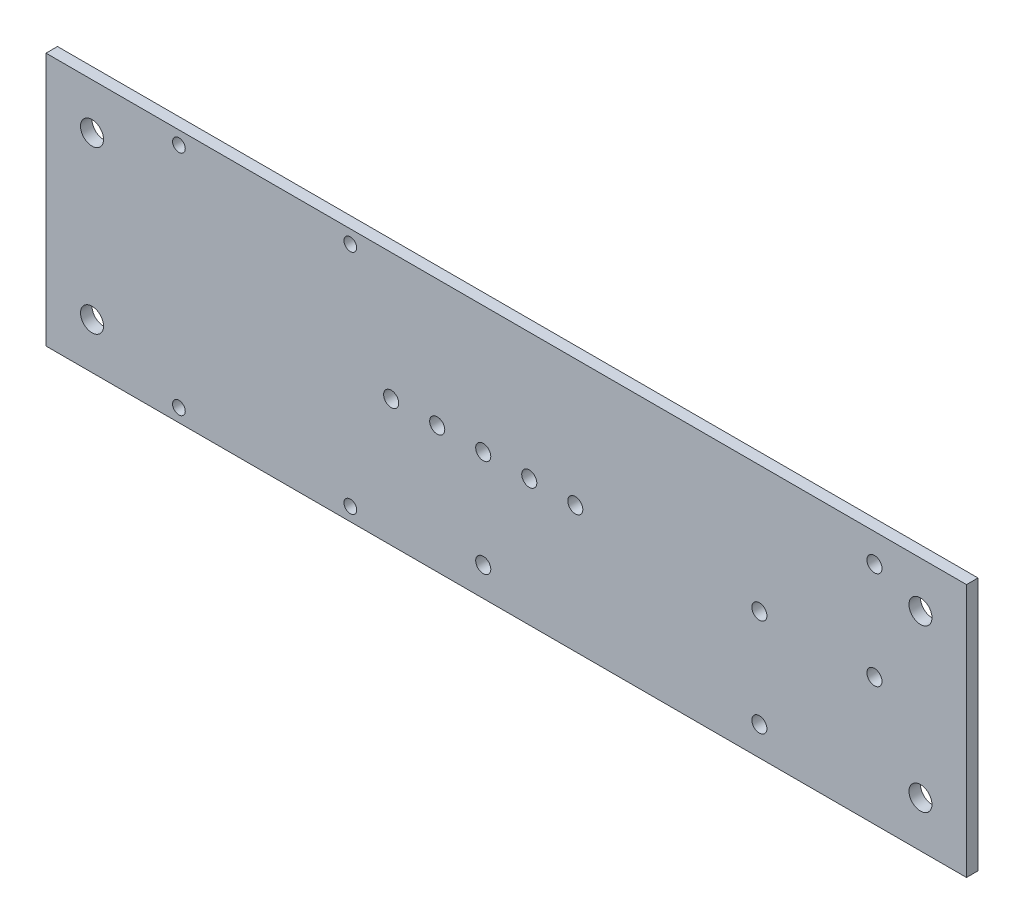
ISO-10303-21;
HEADER;
FILE_DESCRIPTION(('STEP AP214'),'2;1');
FILE_NAME('part.step','',(''),(''),'','','');
FILE_SCHEMA(('AUTOMOTIVE_DESIGN { 1 0 10303 214 1 1 1 1 }'));
ENDSEC;
DATA;
#1=APPLICATION_CONTEXT('core data for automotive mechanical design processes');
#2=APPLICATION_PROTOCOL_DEFINITION('international standard','automotive_design',2000,#1);
#3=PRODUCT_CONTEXT('',#1,'mechanical');
#4=PRODUCT('Part','Part','',(#3));
#5=PRODUCT_RELATED_PRODUCT_CATEGORY('part','',(#4));
#6=PRODUCT_DEFINITION_FORMATION('','',#4);
#7=PRODUCT_DEFINITION_CONTEXT('part definition',#1,'design');
#8=PRODUCT_DEFINITION('design','',#6,#7);
#9=PRODUCT_DEFINITION_SHAPE('','',#8);
#10=(LENGTH_UNIT() NAMED_UNIT(*) SI_UNIT(.MILLI.,.METRE.));
#11=(NAMED_UNIT(*) PLANE_ANGLE_UNIT() SI_UNIT($,.RADIAN.));
#12=(NAMED_UNIT(*) SI_UNIT($,.STERADIAN.) SOLID_ANGLE_UNIT());
#13=UNCERTAINTY_MEASURE_WITH_UNIT(LENGTH_MEASURE(1.E-05),#10,'distance_accuracy_value','');
#14=(GEOMETRIC_REPRESENTATION_CONTEXT(3) GLOBAL_UNCERTAINTY_ASSIGNED_CONTEXT((#13)) GLOBAL_UNIT_ASSIGNED_CONTEXT((#10,
#11,#12)) REPRESENTATION_CONTEXT('',''));
#15=CARTESIAN_POINT('',(0.,0.,0.));
#16=DIRECTION('',(0.,0.,1.));
#17=DIRECTION('',(1.,0.,0.));
#18=AXIS2_PLACEMENT_3D('',#15,#16,#17);
#19=CARTESIAN_POINT('',(0.,0.,3.175));
#20=DIRECTION('',(1.,0.,0.));
#21=DIRECTION('',(0.,0.,-1.));
#22=AXIS2_PLACEMENT_3D('',#19,#20,#21);
#23=PLANE('',#22);
#24=DIRECTION('',(0.,-1.,0.));
#25=VECTOR('',#24,1.);
#26=CARTESIAN_POINT('',(0.,0.,0.));
#27=LINE('',#26,#25);
#28=CARTESIAN_POINT('',(0.,70.,0.));
#29=VERTEX_POINT('',#28);
#30=CARTESIAN_POINT('',(0.,0.,0.));
#31=VERTEX_POINT('',#30);
#32=EDGE_CURVE('E100',#29,#31,#27,.T.);
#33=ORIENTED_EDGE('',*,*,#32,.T.);
#34=DIRECTION('',(0.,0.,-1.));
#35=VECTOR('',#34,1.);
#36=CARTESIAN_POINT('',(0.,0.,3.175));
#37=LINE('',#36,#35);
#38=CARTESIAN_POINT('',(0.,0.,3.175));
#39=VERTEX_POINT('',#38);
#40=EDGE_CURVE('E11',#39,#31,#37,.T.);
#41=ORIENTED_EDGE('',*,*,#40,.F.);
#42=DIRECTION('',(0.,-1.,0.));
#43=VECTOR('',#42,1.);
#44=CARTESIAN_POINT('',(0.,0.,3.175));
#45=LINE('',#44,#43);
#46=CARTESIAN_POINT('',(0.,70.,3.175));
#47=VERTEX_POINT('',#46);
#48=EDGE_CURVE('E88',#47,#39,#45,.T.);
#49=ORIENTED_EDGE('',*,*,#48,.F.);
#50=DIRECTION('',(0.,0.,-1.));
#51=VECTOR('',#50,1.);
#52=CARTESIAN_POINT('',(0.,70.,3.175));
#53=LINE('',#52,#51);
#54=EDGE_CURVE('E96',#47,#29,#53,.T.);
#55=ORIENTED_EDGE('',*,*,#54,.T.);
#56=EDGE_LOOP('',(#33,#41,#49,#55));
#57=FACE_BOUND('',#56,.T.);
#58=ADVANCED_FACE('F37',(#57),#23,.F.);
#59=CARTESIAN_POINT('',(0.,0.,3.175));
#60=DIRECTION('',(0.,1.,0.));
#61=DIRECTION('',(0.,0.,1.));
#62=AXIS2_PLACEMENT_3D('',#59,#60,#61);
#63=PLANE('',#62);
#64=DIRECTION('',(1.,0.,0.));
#65=VECTOR('',#64,1.);
#66=CARTESIAN_POINT('',(0.,0.,0.));
#67=LINE('',#66,#65);
#68=CARTESIAN_POINT('',(254.,0.,0.));
#69=VERTEX_POINT('',#68);
#70=EDGE_CURVE('E92',#31,#69,#67,.T.);
#71=ORIENTED_EDGE('',*,*,#70,.T.);
#72=DIRECTION('',(0.,0.,-1.));
#73=VECTOR('',#72,1.);
#74=CARTESIAN_POINT('',(254.,0.,3.175));
#75=LINE('',#74,#73);
#76=CARTESIAN_POINT('',(254.,0.,3.175));
#77=VERTEX_POINT('',#76);
#78=EDGE_CURVE('E45',#77,#69,#75,.T.);
#79=ORIENTED_EDGE('',*,*,#78,.F.);
#80=DIRECTION('',(1.,0.,0.));
#81=VECTOR('',#80,1.);
#82=CARTESIAN_POINT('',(0.,0.,3.175));
#83=LINE('',#82,#81);
#84=EDGE_CURVE('E83',#39,#77,#83,.T.);
#85=ORIENTED_EDGE('',*,*,#84,.F.);
#86=ORIENTED_EDGE('',*,*,#40,.T.);
#87=EDGE_LOOP('',(#71,#79,#85,#86));
#88=FACE_BOUND('',#87,.T.);
#89=ADVANCED_FACE('F91',(#88),#63,.F.);
#90=CARTESIAN_POINT('',(254.,0.,3.175));
#91=DIRECTION('',(-1.,0.,0.));
#92=DIRECTION('',(0.,0.,1.));
#93=AXIS2_PLACEMENT_3D('',#90,#91,#92);
#94=PLANE('',#93);
#95=DIRECTION('',(0.,1.,0.));
#96=VECTOR('',#95,1.);
#97=CARTESIAN_POINT('',(254.,0.,0.));
#98=LINE('',#97,#96);
#99=CARTESIAN_POINT('',(254.,70.,0.));
#100=VERTEX_POINT('',#99);
#101=EDGE_CURVE('E70',#69,#100,#98,.T.);
#102=ORIENTED_EDGE('',*,*,#101,.T.);
#103=DIRECTION('',(0.,0.,-1.));
#104=VECTOR('',#103,1.);
#105=CARTESIAN_POINT('',(254.,70.,3.175));
#106=LINE('',#105,#104);
#107=CARTESIAN_POINT('',(254.,70.,3.175));
#108=VERTEX_POINT('',#107);
#109=EDGE_CURVE('E93',#108,#100,#106,.T.);
#110=ORIENTED_EDGE('',*,*,#109,.F.);
#111=DIRECTION('',(0.,1.,0.));
#112=VECTOR('',#111,1.);
#113=CARTESIAN_POINT('',(254.,0.,3.175));
#114=LINE('',#113,#112);
#115=EDGE_CURVE('E86',#77,#108,#114,.T.);
#116=ORIENTED_EDGE('',*,*,#115,.F.);
#117=ORIENTED_EDGE('',*,*,#78,.T.);
#118=EDGE_LOOP('',(#102,#110,#116,#117));
#119=FACE_BOUND('',#118,.T.);
#120=ADVANCED_FACE('F94',(#119),#94,.F.);
#121=CARTESIAN_POINT('',(0.,70.,3.175));
#122=DIRECTION('',(0.,-1.,0.));
#123=DIRECTION('',(0.,0.,-1.));
#124=AXIS2_PLACEMENT_3D('',#121,#122,#123);
#125=PLANE('',#124);
#126=DIRECTION('',(-1.,0.,0.));
#127=VECTOR('',#126,1.);
#128=CARTESIAN_POINT('',(0.,70.,0.));
#129=LINE('',#128,#127);
#130=EDGE_CURVE('E76',#100,#29,#129,.T.);
#131=ORIENTED_EDGE('',*,*,#130,.T.);
#132=ORIENTED_EDGE('',*,*,#54,.F.);
#133=DIRECTION('',(-1.,0.,0.));
#134=VECTOR('',#133,1.);
#135=CARTESIAN_POINT('',(0.,70.,3.175));
#136=LINE('',#135,#134);
#137=EDGE_CURVE('E53',#108,#47,#136,.T.);
#138=ORIENTED_EDGE('',*,*,#137,.F.);
#139=ORIENTED_EDGE('',*,*,#109,.T.);
#140=EDGE_LOOP('',(#131,#132,#138,#139));
#141=FACE_BOUND('',#140,.T.);
#142=ADVANCED_FACE('F108',(#141),#125,.F.);
#143=CARTESIAN_POINT('',(0.,0.,3.175));
#144=DIRECTION('',(0.,0.,-1.));
#145=DIRECTION('',(-1.,0.,0.));
#146=AXIS2_PLACEMENT_3D('',#143,#144,#145);
#147=PLANE('',#146);
#148=CARTESIAN_POINT('',(228.6,35.199898,3.175));
#149=DIRECTION('',(0.,0.,1.));
#150=DIRECTION('',(1.,0.,0.));
#151=AXIS2_PLACEMENT_3D('',#148,#149,#150);
#152=CIRCLE('',#151,2.0828);
#153=CARTESIAN_POINT('',(230.6828,35.199898,3.175));
#154=VERTEX_POINT('',#153);
#155=EDGE_CURVE('E218',#154,#154,#152,.T.);
#156=ORIENTED_EDGE('',*,*,#155,.F.);
#157=EDGE_LOOP('',(#156));
#158=FACE_BOUND('',#157,.T.);
#159=CARTESIAN_POINT('',(196.85,8.01250000000001,3.175));
#160=DIRECTION('',(0.,0.,1.));
#161=DIRECTION('',(1.,0.,0.));
#162=AXIS2_PLACEMENT_3D('',#159,#160,#161);
#163=CIRCLE('',#162,2.0828);
#164=CARTESIAN_POINT('',(198.9328,8.01250000000001,3.175));
#165=VERTEX_POINT('',#164);
#166=EDGE_CURVE('E212',#165,#165,#163,.T.);
#167=ORIENTED_EDGE('',*,*,#166,.F.);
#168=EDGE_LOOP('',(#167));
#169=FACE_BOUND('',#168,.T.);
#170=CARTESIAN_POINT('',(120.65,8.01250000000001,3.175));
#171=DIRECTION('',(0.,0.,1.));
#172=DIRECTION('',(1.,0.,0.));
#173=AXIS2_PLACEMENT_3D('',#170,#171,#172);
#174=CIRCLE('',#173,2.0828);
#175=CARTESIAN_POINT('',(122.7328,8.01250000000001,3.175));
#176=VERTEX_POINT('',#175);
#177=EDGE_CURVE('E206',#176,#176,#174,.T.);
#178=ORIENTED_EDGE('',*,*,#177,.F.);
#179=EDGE_LOOP('',(#178));
#180=FACE_BOUND('',#179,.T.);
#181=CARTESIAN_POINT('',(12.7,57.3,3.175));
#182=DIRECTION('',(0.,0.,1.));
#183=DIRECTION('',(1.,0.,0.));
#184=AXIS2_PLACEMENT_3D('',#181,#182,#183);
#185=CIRCLE('',#184,3.175);
#186=CARTESIAN_POINT('',(15.875,57.3,3.175));
#187=VERTEX_POINT('',#186);
#188=EDGE_CURVE('E200',#187,#187,#185,.T.);
#189=ORIENTED_EDGE('',*,*,#188,.F.);
#190=EDGE_LOOP('',(#189));
#191=FACE_BOUND('',#190,.T.);
#192=CARTESIAN_POINT('',(241.3,12.7,3.175));
#193=DIRECTION('',(0.,0.,1.));
#194=DIRECTION('',(1.,0.,0.));
#195=AXIS2_PLACEMENT_3D('',#192,#193,#194);
#196=CIRCLE('',#195,3.17500000000001);
#197=CARTESIAN_POINT('',(244.475,12.7,3.175));
#198=VERTEX_POINT('',#197);
#199=EDGE_CURVE('E194',#198,#198,#196,.T.);
#200=ORIENTED_EDGE('',*,*,#199,.F.);
#201=EDGE_LOOP('',(#200));
#202=FACE_BOUND('',#201,.T.);
#203=CARTESIAN_POINT('',(241.3,57.3,3.175));
#204=DIRECTION('',(0.,0.,1.));
#205=DIRECTION('',(1.,0.,0.));
#206=AXIS2_PLACEMENT_3D('',#203,#204,#205);
#207=CIRCLE('',#206,3.17500000000001);
#208=CARTESIAN_POINT('',(244.475,57.3,3.175));
#209=VERTEX_POINT('',#208);
#210=EDGE_CURVE('E188',#209,#209,#207,.T.);
#211=ORIENTED_EDGE('',*,*,#210,.F.);
#212=EDGE_LOOP('',(#211));
#213=FACE_BOUND('',#212,.T.);
#214=CARTESIAN_POINT('',(12.7,12.7,3.175));
#215=DIRECTION('',(0.,0.,1.));
#216=DIRECTION('',(1.,0.,0.));
#217=AXIS2_PLACEMENT_3D('',#214,#215,#216);
#218=CIRCLE('',#217,3.175);
#219=CARTESIAN_POINT('',(15.875,12.7,3.175));
#220=VERTEX_POINT('',#219);
#221=EDGE_CURVE('E182',#220,#220,#218,.T.);
#222=ORIENTED_EDGE('',*,*,#221,.F.);
#223=EDGE_LOOP('',(#222));
#224=FACE_BOUND('',#223,.T.);
#225=CARTESIAN_POINT('',(36.6736324724129,66.3681092284144,3.175));
#226=DIRECTION('',(0.,0.,1.));
#227=DIRECTION('',(1.,0.,0.));
#228=AXIS2_PLACEMENT_3D('',#225,#226,#227);
#229=CIRCLE('',#228,1.7526);
#230=CARTESIAN_POINT('',(38.4262324724129,66.3681092284144,3.175));
#231=VERTEX_POINT('',#230);
#232=EDGE_CURVE('E176',#231,#231,#229,.T.);
#233=ORIENTED_EDGE('',*,*,#232,.F.);
#234=EDGE_LOOP('',(#233));
#235=FACE_BOUND('',#234,.T.);
#236=CARTESIAN_POINT('',(83.9725886122595,66.3249191923123,3.175));
#237=DIRECTION('',(0.,0.,1.));
#238=DIRECTION('',(1.,0.,0.));
#239=AXIS2_PLACEMENT_3D('',#236,#237,#238);
#240=CIRCLE('',#239,1.75259999999999);
#241=CARTESIAN_POINT('',(85.7251886122595,66.3249191923123,3.175));
#242=VERTEX_POINT('',#241);
#243=EDGE_CURVE('E170',#242,#242,#240,.T.);
#244=ORIENTED_EDGE('',*,*,#243,.F.);
#245=EDGE_LOOP('',(#244));
#246=FACE_BOUND('',#245,.T.);
#247=CARTESIAN_POINT('',(83.9725886122595,3.67508080768771,3.175));
#248=DIRECTION('',(0.,0.,1.));
#249=DIRECTION('',(1.,0.,0.));
#250=AXIS2_PLACEMENT_3D('',#247,#248,#249);
#251=CIRCLE('',#250,1.75259999999999);
#252=CARTESIAN_POINT('',(85.7251886122595,3.67508080768771,3.175));
#253=VERTEX_POINT('',#252);
#254=EDGE_CURVE('E164',#253,#253,#251,.T.);
#255=ORIENTED_EDGE('',*,*,#254,.F.);
#256=EDGE_LOOP('',(#255));
#257=FACE_BOUND('',#256,.T.);
#258=CARTESIAN_POINT('',(36.6736324724129,3.63189077158564,3.175));
#259=DIRECTION('',(0.,0.,1.));
#260=DIRECTION('',(1.,0.,0.));
#261=AXIS2_PLACEMENT_3D('',#258,#259,#260);
#262=CIRCLE('',#261,1.7526);
#263=CARTESIAN_POINT('',(38.4262324724129,3.63189077158564,3.175));
#264=VERTEX_POINT('',#263);
#265=EDGE_CURVE('E158',#264,#264,#262,.T.);
#266=ORIENTED_EDGE('',*,*,#265,.F.);
#267=EDGE_LOOP('',(#266));
#268=FACE_BOUND('',#267,.T.);
#269=CARTESIAN_POINT('',(228.6,62.187398,3.175));
#270=DIRECTION('',(0.,0.,1.));
#271=DIRECTION('',(1.,0.,0.));
#272=AXIS2_PLACEMENT_3D('',#269,#270,#271);
#273=CIRCLE('',#272,2.0828);
#274=CARTESIAN_POINT('',(230.6828,62.187398,3.175));
#275=VERTEX_POINT('',#274);
#276=EDGE_CURVE('E152',#275,#275,#273,.T.);
#277=ORIENTED_EDGE('',*,*,#276,.F.);
#278=EDGE_LOOP('',(#277));
#279=FACE_BOUND('',#278,.T.);
#280=CARTESIAN_POINT('',(196.85,35.,3.175));
#281=DIRECTION('',(0.,0.,1.));
#282=DIRECTION('',(1.,0.,0.));
#283=AXIS2_PLACEMENT_3D('',#280,#281,#282);
#284=CIRCLE('',#283,2.0828);
#285=CARTESIAN_POINT('',(198.9328,35.,3.175));
#286=VERTEX_POINT('',#285);
#287=EDGE_CURVE('E146',#286,#286,#284,.T.);
#288=ORIENTED_EDGE('',*,*,#287,.F.);
#289=EDGE_LOOP('',(#288));
#290=FACE_BOUND('',#289,.T.);
#291=CARTESIAN_POINT('',(95.25,35.,3.175));
#292=DIRECTION('',(0.,0.,1.));
#293=DIRECTION('',(1.,0.,0.));
#294=AXIS2_PLACEMENT_3D('',#291,#292,#293);
#295=CIRCLE('',#294,2.0828);
#296=CARTESIAN_POINT('',(97.3328,35.,3.175));
#297=VERTEX_POINT('',#296);
#298=EDGE_CURVE('E140',#297,#297,#295,.T.);
#299=ORIENTED_EDGE('',*,*,#298,.F.);
#300=EDGE_LOOP('',(#299));
#301=FACE_BOUND('',#300,.T.);
#302=CARTESIAN_POINT('',(120.65,35.,3.175));
#303=DIRECTION('',(0.,0.,1.));
#304=DIRECTION('',(1.,0.,0.));
#305=AXIS2_PLACEMENT_3D('',#302,#303,#304);
#306=CIRCLE('',#305,2.08279999999998);
#307=CARTESIAN_POINT('',(122.7328,35.,3.175));
#308=VERTEX_POINT('',#307);
#309=EDGE_CURVE('E134',#308,#308,#306,.T.);
#310=ORIENTED_EDGE('',*,*,#309,.F.);
#311=EDGE_LOOP('',(#310));
#312=FACE_BOUND('',#311,.T.);
#313=CARTESIAN_POINT('',(146.05,35.,3.175));
#314=DIRECTION('',(0.,0.,1.));
#315=DIRECTION('',(1.,0.,0.));
#316=AXIS2_PLACEMENT_3D('',#313,#314,#315);
#317=CIRCLE('',#316,2.0828);
#318=CARTESIAN_POINT('',(148.1328,35.,3.175));
#319=VERTEX_POINT('',#318);
#320=EDGE_CURVE('E128',#319,#319,#317,.T.);
#321=ORIENTED_EDGE('',*,*,#320,.F.);
#322=EDGE_LOOP('',(#321));
#323=FACE_BOUND('',#322,.T.);
#324=CARTESIAN_POINT('',(133.35,35.,3.175));
#325=DIRECTION('',(0.,0.,1.));
#326=DIRECTION('',(1.,0.,0.));
#327=AXIS2_PLACEMENT_3D('',#324,#325,#326);
#328=CIRCLE('',#327,2.0828);
#329=CARTESIAN_POINT('',(135.4328,35.,3.175));
#330=VERTEX_POINT('',#329);
#331=EDGE_CURVE('E122',#330,#330,#328,.T.);
#332=ORIENTED_EDGE('',*,*,#331,.F.);
#333=EDGE_LOOP('',(#332));
#334=FACE_BOUND('',#333,.T.);
#335=CARTESIAN_POINT('',(107.95,35.,3.175));
#336=DIRECTION('',(0.,0.,1.));
#337=DIRECTION('',(1.,0.,0.));
#338=AXIS2_PLACEMENT_3D('',#335,#336,#337);
#339=CIRCLE('',#338,2.0828);
#340=CARTESIAN_POINT('',(110.0328,35.,3.175));
#341=VERTEX_POINT('',#340);
#342=EDGE_CURVE('E116',#341,#341,#339,.T.);
#343=ORIENTED_EDGE('',*,*,#342,.F.);
#344=EDGE_LOOP('',(#343));
#345=FACE_BOUND('',#344,.T.);
#346=ORIENTED_EDGE('',*,*,#48,.T.);
#347=ORIENTED_EDGE('',*,*,#84,.T.);
#348=ORIENTED_EDGE('',*,*,#115,.T.);
#349=ORIENTED_EDGE('',*,*,#137,.T.);
#350=EDGE_LOOP('',(#346,#347,#348,#349));
#351=FACE_BOUND('',#350,.T.);
#352=ADVANCED_FACE('F84',(#158,#169,#180,#191,#202,#213,#224,#235,#246,#257,#268,#279,#290,#301,
#312,#323,#334,#345,#351),#147,.F.);
#353=CARTESIAN_POINT('',(0.,0.,0.));
#354=DIRECTION('',(0.,0.,-1.));
#355=DIRECTION('',(-1.,0.,0.));
#356=AXIS2_PLACEMENT_3D('',#353,#354,#355);
#357=PLANE('',#356);
#358=CARTESIAN_POINT('',(228.6,35.199898,0.));
#359=DIRECTION('',(0.,0.,1.));
#360=DIRECTION('',(1.,0.,0.));
#361=AXIS2_PLACEMENT_3D('',#358,#359,#360);
#362=CIRCLE('',#361,2.0828);
#363=CARTESIAN_POINT('',(230.6828,35.199898,0.));
#364=VERTEX_POINT('',#363);
#365=EDGE_CURVE('E215',#364,#364,#362,.T.);
#366=ORIENTED_EDGE('',*,*,#365,.T.);
#367=EDGE_LOOP('',(#366));
#368=FACE_BOUND('',#367,.T.);
#369=CARTESIAN_POINT('',(196.85,8.01250000000001,0.));
#370=DIRECTION('',(0.,0.,1.));
#371=DIRECTION('',(1.,0.,0.));
#372=AXIS2_PLACEMENT_3D('',#369,#370,#371);
#373=CIRCLE('',#372,2.0828);
#374=CARTESIAN_POINT('',(198.9328,8.01250000000001,0.));
#375=VERTEX_POINT('',#374);
#376=EDGE_CURVE('E209',#375,#375,#373,.T.);
#377=ORIENTED_EDGE('',*,*,#376,.T.);
#378=EDGE_LOOP('',(#377));
#379=FACE_BOUND('',#378,.T.);
#380=CARTESIAN_POINT('',(120.65,8.01250000000001,0.));
#381=DIRECTION('',(0.,0.,1.));
#382=DIRECTION('',(1.,0.,0.));
#383=AXIS2_PLACEMENT_3D('',#380,#381,#382);
#384=CIRCLE('',#383,2.0828);
#385=CARTESIAN_POINT('',(122.7328,8.01250000000001,0.));
#386=VERTEX_POINT('',#385);
#387=EDGE_CURVE('E203',#386,#386,#384,.T.);
#388=ORIENTED_EDGE('',*,*,#387,.T.);
#389=EDGE_LOOP('',(#388));
#390=FACE_BOUND('',#389,.T.);
#391=CARTESIAN_POINT('',(12.7,57.3,0.));
#392=DIRECTION('',(0.,0.,1.));
#393=DIRECTION('',(1.,0.,0.));
#394=AXIS2_PLACEMENT_3D('',#391,#392,#393);
#395=CIRCLE('',#394,3.175);
#396=CARTESIAN_POINT('',(15.875,57.3,0.));
#397=VERTEX_POINT('',#396);
#398=EDGE_CURVE('E197',#397,#397,#395,.T.);
#399=ORIENTED_EDGE('',*,*,#398,.T.);
#400=EDGE_LOOP('',(#399));
#401=FACE_BOUND('',#400,.T.);
#402=CARTESIAN_POINT('',(241.3,12.7,0.));
#403=DIRECTION('',(0.,0.,1.));
#404=DIRECTION('',(1.,0.,0.));
#405=AXIS2_PLACEMENT_3D('',#402,#403,#404);
#406=CIRCLE('',#405,3.17500000000001);
#407=CARTESIAN_POINT('',(244.475,12.7,0.));
#408=VERTEX_POINT('',#407);
#409=EDGE_CURVE('E191',#408,#408,#406,.T.);
#410=ORIENTED_EDGE('',*,*,#409,.T.);
#411=EDGE_LOOP('',(#410));
#412=FACE_BOUND('',#411,.T.);
#413=CARTESIAN_POINT('',(241.3,57.3,0.));
#414=DIRECTION('',(0.,0.,1.));
#415=DIRECTION('',(1.,0.,0.));
#416=AXIS2_PLACEMENT_3D('',#413,#414,#415);
#417=CIRCLE('',#416,3.17500000000001);
#418=CARTESIAN_POINT('',(244.475,57.3,0.));
#419=VERTEX_POINT('',#418);
#420=EDGE_CURVE('E185',#419,#419,#417,.T.);
#421=ORIENTED_EDGE('',*,*,#420,.T.);
#422=EDGE_LOOP('',(#421));
#423=FACE_BOUND('',#422,.T.);
#424=CARTESIAN_POINT('',(12.7,12.7,0.));
#425=DIRECTION('',(0.,0.,1.));
#426=DIRECTION('',(1.,0.,0.));
#427=AXIS2_PLACEMENT_3D('',#424,#425,#426);
#428=CIRCLE('',#427,3.175);
#429=CARTESIAN_POINT('',(15.875,12.7,0.));
#430=VERTEX_POINT('',#429);
#431=EDGE_CURVE('E179',#430,#430,#428,.T.);
#432=ORIENTED_EDGE('',*,*,#431,.T.);
#433=EDGE_LOOP('',(#432));
#434=FACE_BOUND('',#433,.T.);
#435=CARTESIAN_POINT('',(36.6736324724129,66.3681092284144,0.));
#436=DIRECTION('',(0.,0.,1.));
#437=DIRECTION('',(1.,0.,0.));
#438=AXIS2_PLACEMENT_3D('',#435,#436,#437);
#439=CIRCLE('',#438,1.7526);
#440=CARTESIAN_POINT('',(38.4262324724129,66.3681092284144,0.));
#441=VERTEX_POINT('',#440);
#442=EDGE_CURVE('E173',#441,#441,#439,.T.);
#443=ORIENTED_EDGE('',*,*,#442,.T.);
#444=EDGE_LOOP('',(#443));
#445=FACE_BOUND('',#444,.T.);
#446=CARTESIAN_POINT('',(83.9725886122595,66.3249191923123,0.));
#447=DIRECTION('',(0.,0.,1.));
#448=DIRECTION('',(1.,0.,0.));
#449=AXIS2_PLACEMENT_3D('',#446,#447,#448);
#450=CIRCLE('',#449,1.75259999999999);
#451=CARTESIAN_POINT('',(85.7251886122595,66.3249191923123,0.));
#452=VERTEX_POINT('',#451);
#453=EDGE_CURVE('E167',#452,#452,#450,.T.);
#454=ORIENTED_EDGE('',*,*,#453,.T.);
#455=EDGE_LOOP('',(#454));
#456=FACE_BOUND('',#455,.T.);
#457=CARTESIAN_POINT('',(83.9725886122595,3.67508080768771,0.));
#458=DIRECTION('',(0.,0.,1.));
#459=DIRECTION('',(1.,0.,0.));
#460=AXIS2_PLACEMENT_3D('',#457,#458,#459);
#461=CIRCLE('',#460,1.75259999999999);
#462=CARTESIAN_POINT('',(85.7251886122595,3.67508080768771,0.));
#463=VERTEX_POINT('',#462);
#464=EDGE_CURVE('E161',#463,#463,#461,.T.);
#465=ORIENTED_EDGE('',*,*,#464,.T.);
#466=EDGE_LOOP('',(#465));
#467=FACE_BOUND('',#466,.T.);
#468=CARTESIAN_POINT('',(36.6736324724129,3.63189077158564,0.));
#469=DIRECTION('',(0.,0.,1.));
#470=DIRECTION('',(1.,0.,0.));
#471=AXIS2_PLACEMENT_3D('',#468,#469,#470);
#472=CIRCLE('',#471,1.7526);
#473=CARTESIAN_POINT('',(38.4262324724129,3.63189077158564,0.));
#474=VERTEX_POINT('',#473);
#475=EDGE_CURVE('E155',#474,#474,#472,.T.);
#476=ORIENTED_EDGE('',*,*,#475,.T.);
#477=EDGE_LOOP('',(#476));
#478=FACE_BOUND('',#477,.T.);
#479=CARTESIAN_POINT('',(228.6,62.187398,0.));
#480=DIRECTION('',(0.,0.,1.));
#481=DIRECTION('',(1.,0.,0.));
#482=AXIS2_PLACEMENT_3D('',#479,#480,#481);
#483=CIRCLE('',#482,2.0828);
#484=CARTESIAN_POINT('',(230.6828,62.187398,0.));
#485=VERTEX_POINT('',#484);
#486=EDGE_CURVE('E149',#485,#485,#483,.T.);
#487=ORIENTED_EDGE('',*,*,#486,.T.);
#488=EDGE_LOOP('',(#487));
#489=FACE_BOUND('',#488,.T.);
#490=CARTESIAN_POINT('',(196.85,35.,0.));
#491=DIRECTION('',(0.,0.,1.));
#492=DIRECTION('',(1.,0.,0.));
#493=AXIS2_PLACEMENT_3D('',#490,#491,#492);
#494=CIRCLE('',#493,2.0828);
#495=CARTESIAN_POINT('',(198.9328,35.,0.));
#496=VERTEX_POINT('',#495);
#497=EDGE_CURVE('E143',#496,#496,#494,.T.);
#498=ORIENTED_EDGE('',*,*,#497,.T.);
#499=EDGE_LOOP('',(#498));
#500=FACE_BOUND('',#499,.T.);
#501=CARTESIAN_POINT('',(95.25,35.,0.));
#502=DIRECTION('',(0.,0.,1.));
#503=DIRECTION('',(1.,0.,0.));
#504=AXIS2_PLACEMENT_3D('',#501,#502,#503);
#505=CIRCLE('',#504,2.0828);
#506=CARTESIAN_POINT('',(97.3328,35.,0.));
#507=VERTEX_POINT('',#506);
#508=EDGE_CURVE('E137',#507,#507,#505,.T.);
#509=ORIENTED_EDGE('',*,*,#508,.T.);
#510=EDGE_LOOP('',(#509));
#511=FACE_BOUND('',#510,.T.);
#512=CARTESIAN_POINT('',(120.65,35.,0.));
#513=DIRECTION('',(0.,0.,1.));
#514=DIRECTION('',(1.,0.,0.));
#515=AXIS2_PLACEMENT_3D('',#512,#513,#514);
#516=CIRCLE('',#515,2.0828);
#517=CARTESIAN_POINT('',(122.7328,35.,0.));
#518=VERTEX_POINT('',#517);
#519=EDGE_CURVE('E131',#518,#518,#516,.T.);
#520=ORIENTED_EDGE('',*,*,#519,.T.);
#521=EDGE_LOOP('',(#520));
#522=FACE_BOUND('',#521,.T.);
#523=CARTESIAN_POINT('',(146.05,35.,0.));
#524=DIRECTION('',(0.,0.,1.));
#525=DIRECTION('',(1.,0.,0.));
#526=AXIS2_PLACEMENT_3D('',#523,#524,#525);
#527=CIRCLE('',#526,2.0828);
#528=CARTESIAN_POINT('',(148.1328,35.,0.));
#529=VERTEX_POINT('',#528);
#530=EDGE_CURVE('E125',#529,#529,#527,.T.);
#531=ORIENTED_EDGE('',*,*,#530,.T.);
#532=EDGE_LOOP('',(#531));
#533=FACE_BOUND('',#532,.T.);
#534=CARTESIAN_POINT('',(133.35,35.,0.));
#535=DIRECTION('',(0.,0.,1.));
#536=DIRECTION('',(1.,0.,0.));
#537=AXIS2_PLACEMENT_3D('',#534,#535,#536);
#538=CIRCLE('',#537,2.0828);
#539=CARTESIAN_POINT('',(135.4328,35.,0.));
#540=VERTEX_POINT('',#539);
#541=EDGE_CURVE('E119',#540,#540,#538,.T.);
#542=ORIENTED_EDGE('',*,*,#541,.T.);
#543=EDGE_LOOP('',(#542));
#544=FACE_BOUND('',#543,.T.);
#545=CARTESIAN_POINT('',(107.95,35.,0.));
#546=DIRECTION('',(0.,0.,1.));
#547=DIRECTION('',(1.,0.,0.));
#548=AXIS2_PLACEMENT_3D('',#545,#546,#547);
#549=CIRCLE('',#548,2.0828);
#550=CARTESIAN_POINT('',(110.0328,35.,0.));
#551=VERTEX_POINT('',#550);
#552=EDGE_CURVE('E103',#551,#551,#549,.T.);
#553=ORIENTED_EDGE('',*,*,#552,.T.);
#554=EDGE_LOOP('',(#553));
#555=FACE_BOUND('',#554,.T.);
#556=ORIENTED_EDGE('',*,*,#32,.F.);
#557=ORIENTED_EDGE('',*,*,#130,.F.);
#558=ORIENTED_EDGE('',*,*,#101,.F.);
#559=ORIENTED_EDGE('',*,*,#70,.F.);
#560=EDGE_LOOP('',(#556,#557,#558,#559));
#561=FACE_BOUND('',#560,.T.);
#562=ADVANCED_FACE('F111',(#368,#379,#390,#401,#412,#423,#434,#445,#456,#467,#478,#489,#500,
#511,#522,#533,#544,#555,#561),#357,.T.);
#563=CARTESIAN_POINT('',(107.95,35.,3.175));
#564=DIRECTION('',(0.,0.,1.));
#565=DIRECTION('',(1.,0.,0.));
#566=AXIS2_PLACEMENT_3D('',#563,#564,#565);
#567=CYLINDRICAL_SURFACE('',#566,2.0828);
#568=ORIENTED_EDGE('',*,*,#552,.F.);
#569=EDGE_LOOP('',(#568));
#570=FACE_BOUND('',#569,.T.);
#571=ORIENTED_EDGE('',*,*,#342,.T.);
#572=EDGE_LOOP('',(#571));
#573=FACE_BOUND('',#572,.T.);
#574=ADVANCED_FACE('F261',(#570,#573),#567,.F.);
#575=CARTESIAN_POINT('',(133.35,35.,3.175));
#576=DIRECTION('',(0.,0.,1.));
#577=DIRECTION('',(1.,0.,0.));
#578=AXIS2_PLACEMENT_3D('',#575,#576,#577);
#579=CYLINDRICAL_SURFACE('',#578,2.0828);
#580=ORIENTED_EDGE('',*,*,#541,.F.);
#581=EDGE_LOOP('',(#580));
#582=FACE_BOUND('',#581,.T.);
#583=ORIENTED_EDGE('',*,*,#331,.T.);
#584=EDGE_LOOP('',(#583));
#585=FACE_BOUND('',#584,.T.);
#586=ADVANCED_FACE('F263',(#582,#585),#579,.F.);
#587=CARTESIAN_POINT('',(146.05,35.,3.175));
#588=DIRECTION('',(0.,0.,1.));
#589=DIRECTION('',(1.,0.,0.));
#590=AXIS2_PLACEMENT_3D('',#587,#588,#589);
#591=CYLINDRICAL_SURFACE('',#590,2.0828);
#592=ORIENTED_EDGE('',*,*,#530,.F.);
#593=EDGE_LOOP('',(#592));
#594=FACE_BOUND('',#593,.T.);
#595=ORIENTED_EDGE('',*,*,#320,.T.);
#596=EDGE_LOOP('',(#595));
#597=FACE_BOUND('',#596,.T.);
#598=ADVANCED_FACE('F270',(#594,#597),#591,.F.);
#599=CARTESIAN_POINT('',(120.65,35.,3.175));
#600=DIRECTION('',(0.,0.,1.));
#601=DIRECTION('',(1.,0.,0.));
#602=AXIS2_PLACEMENT_3D('',#599,#600,#601);
#603=CYLINDRICAL_SURFACE('',#602,2.08279999999999);
#604=ORIENTED_EDGE('',*,*,#519,.F.);
#605=EDGE_LOOP('',(#604));
#606=FACE_BOUND('',#605,.T.);
#607=ORIENTED_EDGE('',*,*,#309,.T.);
#608=EDGE_LOOP('',(#607));
#609=FACE_BOUND('',#608,.T.);
#610=ADVANCED_FACE('F379',(#606,#609),#603,.F.);
#611=CARTESIAN_POINT('',(95.25,35.,3.175));
#612=DIRECTION('',(0.,0.,1.));
#613=DIRECTION('',(1.,0.,0.));
#614=AXIS2_PLACEMENT_3D('',#611,#612,#613);
#615=CYLINDRICAL_SURFACE('',#614,2.0828);
#616=ORIENTED_EDGE('',*,*,#508,.F.);
#617=EDGE_LOOP('',(#616));
#618=FACE_BOUND('',#617,.T.);
#619=ORIENTED_EDGE('',*,*,#298,.T.);
#620=EDGE_LOOP('',(#619));
#621=FACE_BOUND('',#620,.T.);
#622=ADVANCED_FACE('F375',(#618,#621),#615,.F.);
#623=CARTESIAN_POINT('',(196.85,35.,3.175));
#624=DIRECTION('',(0.,0.,1.));
#625=DIRECTION('',(1.,0.,0.));
#626=AXIS2_PLACEMENT_3D('',#623,#624,#625);
#627=CYLINDRICAL_SURFACE('',#626,2.0828);
#628=ORIENTED_EDGE('',*,*,#497,.F.);
#629=EDGE_LOOP('',(#628));
#630=FACE_BOUND('',#629,.T.);
#631=ORIENTED_EDGE('',*,*,#287,.T.);
#632=EDGE_LOOP('',(#631));
#633=FACE_BOUND('',#632,.T.);
#634=ADVANCED_FACE('F371',(#630,#633),#627,.F.);
#635=CARTESIAN_POINT('',(228.6,62.187398,3.175));
#636=DIRECTION('',(0.,0.,1.));
#637=DIRECTION('',(1.,0.,0.));
#638=AXIS2_PLACEMENT_3D('',#635,#636,#637);
#639=CYLINDRICAL_SURFACE('',#638,2.0828);
#640=ORIENTED_EDGE('',*,*,#486,.F.);
#641=EDGE_LOOP('',(#640));
#642=FACE_BOUND('',#641,.T.);
#643=ORIENTED_EDGE('',*,*,#276,.T.);
#644=EDGE_LOOP('',(#643));
#645=FACE_BOUND('',#644,.T.);
#646=ADVANCED_FACE('F367',(#642,#645),#639,.F.);
#647=CARTESIAN_POINT('',(36.6736324724129,3.63189077158564,3.175));
#648=DIRECTION('',(0.,0.,1.));
#649=DIRECTION('',(1.,0.,0.));
#650=AXIS2_PLACEMENT_3D('',#647,#648,#649);
#651=CYLINDRICAL_SURFACE('',#650,1.7526);
#652=ORIENTED_EDGE('',*,*,#475,.F.);
#653=EDGE_LOOP('',(#652));
#654=FACE_BOUND('',#653,.T.);
#655=ORIENTED_EDGE('',*,*,#265,.T.);
#656=EDGE_LOOP('',(#655));
#657=FACE_BOUND('',#656,.T.);
#658=ADVANCED_FACE('F363',(#654,#657),#651,.F.);
#659=CARTESIAN_POINT('',(83.9725886122595,3.67508080768771,3.175));
#660=DIRECTION('',(0.,0.,1.));
#661=DIRECTION('',(1.,0.,0.));
#662=AXIS2_PLACEMENT_3D('',#659,#660,#661);
#663=CYLINDRICAL_SURFACE('',#662,1.75259999999999);
#664=ORIENTED_EDGE('',*,*,#464,.F.);
#665=EDGE_LOOP('',(#664));
#666=FACE_BOUND('',#665,.T.);
#667=ORIENTED_EDGE('',*,*,#254,.T.);
#668=EDGE_LOOP('',(#667));
#669=FACE_BOUND('',#668,.T.);
#670=ADVANCED_FACE('F359',(#666,#669),#663,.F.);
#671=CARTESIAN_POINT('',(83.9725886122595,66.3249191923123,3.175));
#672=DIRECTION('',(0.,0.,1.));
#673=DIRECTION('',(1.,0.,0.));
#674=AXIS2_PLACEMENT_3D('',#671,#672,#673);
#675=CYLINDRICAL_SURFACE('',#674,1.75259999999999);
#676=ORIENTED_EDGE('',*,*,#453,.F.);
#677=EDGE_LOOP('',(#676));
#678=FACE_BOUND('',#677,.T.);
#679=ORIENTED_EDGE('',*,*,#243,.T.);
#680=EDGE_LOOP('',(#679));
#681=FACE_BOUND('',#680,.T.);
#682=ADVANCED_FACE('F355',(#678,#681),#675,.F.);
#683=CARTESIAN_POINT('',(36.6736324724129,66.3681092284144,3.175));
#684=DIRECTION('',(0.,0.,1.));
#685=DIRECTION('',(1.,0.,0.));
#686=AXIS2_PLACEMENT_3D('',#683,#684,#685);
#687=CYLINDRICAL_SURFACE('',#686,1.7526);
#688=ORIENTED_EDGE('',*,*,#442,.F.);
#689=EDGE_LOOP('',(#688));
#690=FACE_BOUND('',#689,.T.);
#691=ORIENTED_EDGE('',*,*,#232,.T.);
#692=EDGE_LOOP('',(#691));
#693=FACE_BOUND('',#692,.T.);
#694=ADVANCED_FACE('F351',(#690,#693),#687,.F.);
#695=CARTESIAN_POINT('',(12.7,12.7,3.175));
#696=DIRECTION('',(0.,0.,1.));
#697=DIRECTION('',(1.,0.,0.));
#698=AXIS2_PLACEMENT_3D('',#695,#696,#697);
#699=CYLINDRICAL_SURFACE('',#698,3.175);
#700=ORIENTED_EDGE('',*,*,#431,.F.);
#701=EDGE_LOOP('',(#700));
#702=FACE_BOUND('',#701,.T.);
#703=ORIENTED_EDGE('',*,*,#221,.T.);
#704=EDGE_LOOP('',(#703));
#705=FACE_BOUND('',#704,.T.);
#706=ADVANCED_FACE('F347',(#702,#705),#699,.F.);
#707=CARTESIAN_POINT('',(241.3,57.3,3.175));
#708=DIRECTION('',(0.,0.,1.));
#709=DIRECTION('',(1.,0.,0.));
#710=AXIS2_PLACEMENT_3D('',#707,#708,#709);
#711=CYLINDRICAL_SURFACE('',#710,3.17500000000001);
#712=ORIENTED_EDGE('',*,*,#420,.F.);
#713=EDGE_LOOP('',(#712));
#714=FACE_BOUND('',#713,.T.);
#715=ORIENTED_EDGE('',*,*,#210,.T.);
#716=EDGE_LOOP('',(#715));
#717=FACE_BOUND('',#716,.T.);
#718=ADVANCED_FACE('F343',(#714,#717),#711,.F.);
#719=CARTESIAN_POINT('',(241.3,12.7,3.175));
#720=DIRECTION('',(0.,0.,1.));
#721=DIRECTION('',(1.,0.,0.));
#722=AXIS2_PLACEMENT_3D('',#719,#720,#721);
#723=CYLINDRICAL_SURFACE('',#722,3.17500000000001);
#724=ORIENTED_EDGE('',*,*,#409,.F.);
#725=EDGE_LOOP('',(#724));
#726=FACE_BOUND('',#725,.T.);
#727=ORIENTED_EDGE('',*,*,#199,.T.);
#728=EDGE_LOOP('',(#727));
#729=FACE_BOUND('',#728,.T.);
#730=ADVANCED_FACE('F339',(#726,#729),#723,.F.);
#731=CARTESIAN_POINT('',(12.7,57.3,3.175));
#732=DIRECTION('',(0.,0.,1.));
#733=DIRECTION('',(1.,0.,0.));
#734=AXIS2_PLACEMENT_3D('',#731,#732,#733);
#735=CYLINDRICAL_SURFACE('',#734,3.175);
#736=ORIENTED_EDGE('',*,*,#398,.F.);
#737=EDGE_LOOP('',(#736));
#738=FACE_BOUND('',#737,.T.);
#739=ORIENTED_EDGE('',*,*,#188,.T.);
#740=EDGE_LOOP('',(#739));
#741=FACE_BOUND('',#740,.T.);
#742=ADVANCED_FACE('F311',(#738,#741),#735,.F.);
#743=CARTESIAN_POINT('',(120.65,8.01250000000001,3.175));
#744=DIRECTION('',(0.,0.,1.));
#745=DIRECTION('',(1.,0.,0.));
#746=AXIS2_PLACEMENT_3D('',#743,#744,#745);
#747=CYLINDRICAL_SURFACE('',#746,2.0828);
#748=ORIENTED_EDGE('',*,*,#387,.F.);
#749=EDGE_LOOP('',(#748));
#750=FACE_BOUND('',#749,.T.);
#751=ORIENTED_EDGE('',*,*,#177,.T.);
#752=EDGE_LOOP('',(#751));
#753=FACE_BOUND('',#752,.T.);
#754=ADVANCED_FACE('F305',(#750,#753),#747,.F.);
#755=CARTESIAN_POINT('',(196.85,8.01250000000001,3.175));
#756=DIRECTION('',(0.,0.,1.));
#757=DIRECTION('',(1.,0.,0.));
#758=AXIS2_PLACEMENT_3D('',#755,#756,#757);
#759=CYLINDRICAL_SURFACE('',#758,2.0828);
#760=ORIENTED_EDGE('',*,*,#376,.F.);
#761=EDGE_LOOP('',(#760));
#762=FACE_BOUND('',#761,.T.);
#763=ORIENTED_EDGE('',*,*,#166,.T.);
#764=EDGE_LOOP('',(#763));
#765=FACE_BOUND('',#764,.T.);
#766=ADVANCED_FACE('F310',(#762,#765),#759,.F.);
#767=CARTESIAN_POINT('',(228.6,35.199898,3.175));
#768=DIRECTION('',(0.,0.,1.));
#769=DIRECTION('',(1.,0.,0.));
#770=AXIS2_PLACEMENT_3D('',#767,#768,#769);
#771=CYLINDRICAL_SURFACE('',#770,2.0828);
#772=ORIENTED_EDGE('',*,*,#365,.F.);
#773=EDGE_LOOP('',(#772));
#774=FACE_BOUND('',#773,.T.);
#775=ORIENTED_EDGE('',*,*,#155,.T.);
#776=EDGE_LOOP('',(#775));
#777=FACE_BOUND('',#776,.T.);
#778=ADVANCED_FACE('F222',(#774,#777),#771,.F.);
#779=CLOSED_SHELL('',(#58,#89,#120,#142,#352,#562,#574,#586,#598,#610,#622,#634,#646,#658,#670,
#682,#694,#706,#718,#730,#742,#754,#766,#778));
#780=MANIFOLD_SOLID_BREP('B2',#779);
#781=ADVANCED_BREP_SHAPE_REPRESENTATION('',(#18,#780),#14);
#782=SHAPE_DEFINITION_REPRESENTATION(#9,#781);
ENDSEC;
END-ISO-10303-21;
